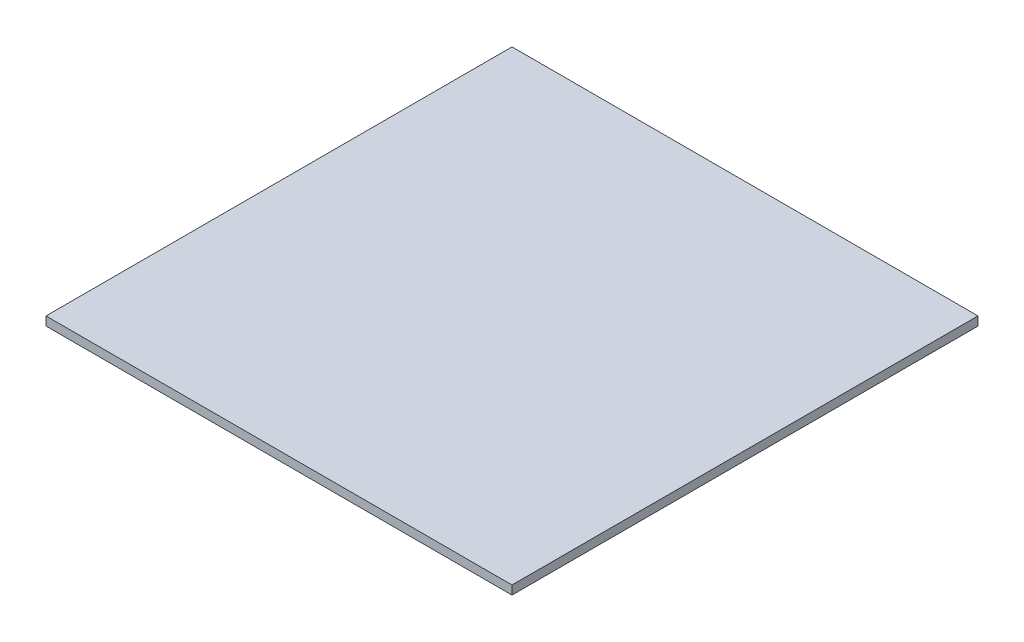
ISO-10303-21;
HEADER;
FILE_DESCRIPTION(('STEP AP214'),'2;1');
FILE_NAME('part.step','',(''),(''),'','','');
FILE_SCHEMA(('AUTOMOTIVE_DESIGN { 1 0 10303 214 1 1 1 1 }'));
ENDSEC;
DATA;
#1=APPLICATION_CONTEXT('core data for automotive mechanical design processes');
#2=APPLICATION_PROTOCOL_DEFINITION('international standard','automotive_design',2000,#1);
#3=PRODUCT_CONTEXT('',#1,'mechanical');
#4=PRODUCT('Part','Part','',(#3));
#5=PRODUCT_RELATED_PRODUCT_CATEGORY('part','',(#4));
#6=PRODUCT_DEFINITION_FORMATION('','',#4);
#7=PRODUCT_DEFINITION_CONTEXT('part definition',#1,'design');
#8=PRODUCT_DEFINITION('design','',#6,#7);
#9=PRODUCT_DEFINITION_SHAPE('','',#8);
#10=(LENGTH_UNIT() NAMED_UNIT(*) SI_UNIT(.MILLI.,.METRE.));
#11=(NAMED_UNIT(*) PLANE_ANGLE_UNIT() SI_UNIT($,.RADIAN.));
#12=(NAMED_UNIT(*) SI_UNIT($,.STERADIAN.) SOLID_ANGLE_UNIT());
#13=UNCERTAINTY_MEASURE_WITH_UNIT(LENGTH_MEASURE(1.E-05),#10,'distance_accuracy_value','');
#14=(GEOMETRIC_REPRESENTATION_CONTEXT(3) GLOBAL_UNCERTAINTY_ASSIGNED_CONTEXT((#13)) GLOBAL_UNIT_ASSIGNED_CONTEXT((#10,
#11,#12)) REPRESENTATION_CONTEXT('',''));
#15=CARTESIAN_POINT('',(0.,0.,0.));
#16=DIRECTION('',(0.,0.,1.));
#17=DIRECTION('',(1.,0.,0.));
#18=AXIS2_PLACEMENT_3D('',#15,#16,#17);
#19=CARTESIAN_POINT('',(265.,10.,265.));
#20=DIRECTION('',(-1.,0.,0.));
#21=DIRECTION('',(0.,0.,1.));
#22=AXIS2_PLACEMENT_3D('',#19,#20,#21);
#23=PLANE('',#22);
#24=DIRECTION('',(0.,0.,-1.));
#25=VECTOR('',#24,1.);
#26=CARTESIAN_POINT('',(265.,0.,265.));
#27=LINE('',#26,#25);
#28=CARTESIAN_POINT('',(265.,0.,265.));
#29=VERTEX_POINT('',#28);
#30=CARTESIAN_POINT('',(265.,0.,-265.));
#31=VERTEX_POINT('',#30);
#32=EDGE_CURVE('E107',#29,#31,#27,.T.);
#33=ORIENTED_EDGE('',*,*,#32,.T.);
#34=DIRECTION('',(0.,-1.,0.));
#35=VECTOR('',#34,1.);
#36=CARTESIAN_POINT('',(265.,10.,-265.));
#37=LINE('',#36,#35);
#38=CARTESIAN_POINT('',(265.,10.,-265.));
#39=VERTEX_POINT('',#38);
#40=EDGE_CURVE('E11',#39,#31,#37,.T.);
#41=ORIENTED_EDGE('',*,*,#40,.F.);
#42=DIRECTION('',(0.,0.,-1.));
#43=VECTOR('',#42,1.);
#44=CARTESIAN_POINT('',(265.,10.,265.));
#45=LINE('',#44,#43);
#46=CARTESIAN_POINT('',(265.,10.,265.));
#47=VERTEX_POINT('',#46);
#48=EDGE_CURVE('E91',#47,#39,#45,.T.);
#49=ORIENTED_EDGE('',*,*,#48,.F.);
#50=DIRECTION('',(0.,-1.,0.));
#51=VECTOR('',#50,1.);
#52=CARTESIAN_POINT('',(265.,10.,265.));
#53=LINE('',#52,#51);
#54=EDGE_CURVE('E103',#47,#29,#53,.T.);
#55=ORIENTED_EDGE('',*,*,#54,.T.);
#56=EDGE_LOOP('',(#33,#41,#49,#55));
#57=FACE_BOUND('',#56,.T.);
#58=ADVANCED_FACE('F39',(#57),#23,.F.);
#59=CARTESIAN_POINT('',(-265.,10.,-265.));
#60=DIRECTION('',(0.,0.,1.));
#61=DIRECTION('',(1.,0.,0.));
#62=AXIS2_PLACEMENT_3D('',#59,#60,#61);
#63=PLANE('',#62);
#64=DIRECTION('',(-1.,0.,0.));
#65=VECTOR('',#64,1.);
#66=CARTESIAN_POINT('',(-265.,0.,-265.));
#67=LINE('',#66,#65);
#68=CARTESIAN_POINT('',(-265.,0.,-265.));
#69=VERTEX_POINT('',#68);
#70=EDGE_CURVE('E96',#31,#69,#67,.T.);
#71=ORIENTED_EDGE('',*,*,#70,.T.);
#72=DIRECTION('',(0.,-1.,0.));
#73=VECTOR('',#72,1.);
#74=CARTESIAN_POINT('',(-265.,10.,-265.));
#75=LINE('',#74,#73);
#76=CARTESIAN_POINT('',(-265.,10.,-265.));
#77=VERTEX_POINT('',#76);
#78=EDGE_CURVE('E48',#77,#69,#75,.T.);
#79=ORIENTED_EDGE('',*,*,#78,.F.);
#80=DIRECTION('',(-1.,0.,0.));
#81=VECTOR('',#80,1.);
#82=CARTESIAN_POINT('',(-265.,10.,-265.));
#83=LINE('',#82,#81);
#84=EDGE_CURVE('E86',#39,#77,#83,.T.);
#85=ORIENTED_EDGE('',*,*,#84,.F.);
#86=ORIENTED_EDGE('',*,*,#40,.T.);
#87=EDGE_LOOP('',(#71,#79,#85,#86));
#88=FACE_BOUND('',#87,.T.);
#89=ADVANCED_FACE('F95',(#88),#63,.F.);
#90=CARTESIAN_POINT('',(-265.,10.,265.));
#91=DIRECTION('',(1.,0.,0.));
#92=DIRECTION('',(0.,0.,-1.));
#93=AXIS2_PLACEMENT_3D('',#90,#91,#92);
#94=PLANE('',#93);
#95=DIRECTION('',(0.,0.,1.));
#96=VECTOR('',#95,1.);
#97=CARTESIAN_POINT('',(-265.,0.,265.));
#98=LINE('',#97,#96);
#99=CARTESIAN_POINT('',(-265.,0.,265.));
#100=VERTEX_POINT('',#99);
#101=EDGE_CURVE('E73',#69,#100,#98,.T.);
#102=ORIENTED_EDGE('',*,*,#101,.T.);
#103=DIRECTION('',(0.,-1.,0.));
#104=VECTOR('',#103,1.);
#105=CARTESIAN_POINT('',(-265.,10.,265.));
#106=LINE('',#105,#104);
#107=CARTESIAN_POINT('',(-265.,10.,265.));
#108=VERTEX_POINT('',#107);
#109=EDGE_CURVE('E98',#108,#100,#106,.T.);
#110=ORIENTED_EDGE('',*,*,#109,.F.);
#111=DIRECTION('',(0.,0.,1.));
#112=VECTOR('',#111,1.);
#113=CARTESIAN_POINT('',(-265.,10.,265.));
#114=LINE('',#113,#112);
#115=EDGE_CURVE('E89',#77,#108,#114,.T.);
#116=ORIENTED_EDGE('',*,*,#115,.F.);
#117=ORIENTED_EDGE('',*,*,#78,.T.);
#118=EDGE_LOOP('',(#102,#110,#116,#117));
#119=FACE_BOUND('',#118,.T.);
#120=ADVANCED_FACE('F99',(#119),#94,.F.);
#121=CARTESIAN_POINT('',(-265.,10.,265.));
#122=DIRECTION('',(0.,0.,-1.));
#123=DIRECTION('',(-1.,0.,0.));
#124=AXIS2_PLACEMENT_3D('',#121,#122,#123);
#125=PLANE('',#124);
#126=DIRECTION('',(1.,0.,0.));
#127=VECTOR('',#126,1.);
#128=CARTESIAN_POINT('',(-265.,0.,265.));
#129=LINE('',#128,#127);
#130=EDGE_CURVE('E79',#100,#29,#129,.T.);
#131=ORIENTED_EDGE('',*,*,#130,.T.);
#132=ORIENTED_EDGE('',*,*,#54,.F.);
#133=DIRECTION('',(1.,0.,0.));
#134=VECTOR('',#133,1.);
#135=CARTESIAN_POINT('',(-265.,10.,265.));
#136=LINE('',#135,#134);
#137=EDGE_CURVE('E56',#108,#47,#136,.T.);
#138=ORIENTED_EDGE('',*,*,#137,.F.);
#139=ORIENTED_EDGE('',*,*,#109,.T.);
#140=EDGE_LOOP('',(#131,#132,#138,#139));
#141=FACE_BOUND('',#140,.T.);
#142=ADVANCED_FACE('F120',(#141),#125,.F.);
#143=CARTESIAN_POINT('',(0.,10.,0.));
#144=DIRECTION('',(0.,-1.,0.));
#145=DIRECTION('',(0.,0.,-1.));
#146=AXIS2_PLACEMENT_3D('',#143,#144,#145);
#147=PLANE('',#146);
#148=ORIENTED_EDGE('',*,*,#48,.T.);
#149=ORIENTED_EDGE('',*,*,#84,.T.);
#150=ORIENTED_EDGE('',*,*,#115,.T.);
#151=ORIENTED_EDGE('',*,*,#137,.T.);
#152=EDGE_LOOP('',(#148,#149,#150,#151));
#153=FACE_BOUND('',#152,.T.);
#154=ADVANCED_FACE('F87',(#153),#147,.F.);
#155=CARTESIAN_POINT('',(0.,0.,0.));
#156=DIRECTION('',(0.,-1.,0.));
#157=DIRECTION('',(0.,0.,-1.));
#158=AXIS2_PLACEMENT_3D('',#155,#156,#157);
#159=PLANE('',#158);
#160=ORIENTED_EDGE('',*,*,#32,.F.);
#161=ORIENTED_EDGE('',*,*,#130,.F.);
#162=ORIENTED_EDGE('',*,*,#101,.F.);
#163=ORIENTED_EDGE('',*,*,#70,.F.);
#164=EDGE_LOOP('',(#160,#161,#162,#163));
#165=FACE_BOUND('',#164,.T.);
#166=ADVANCED_FACE('F123',(#165),#159,.T.);
#167=CLOSED_SHELL('',(#58,#89,#120,#142,#154,#166));
#168=MANIFOLD_SOLID_BREP('B2',#167);
#169=ADVANCED_BREP_SHAPE_REPRESENTATION('',(#18,#168),#14);
#170=SHAPE_DEFINITION_REPRESENTATION(#9,#169);
ENDSEC;
END-ISO-10303-21;
